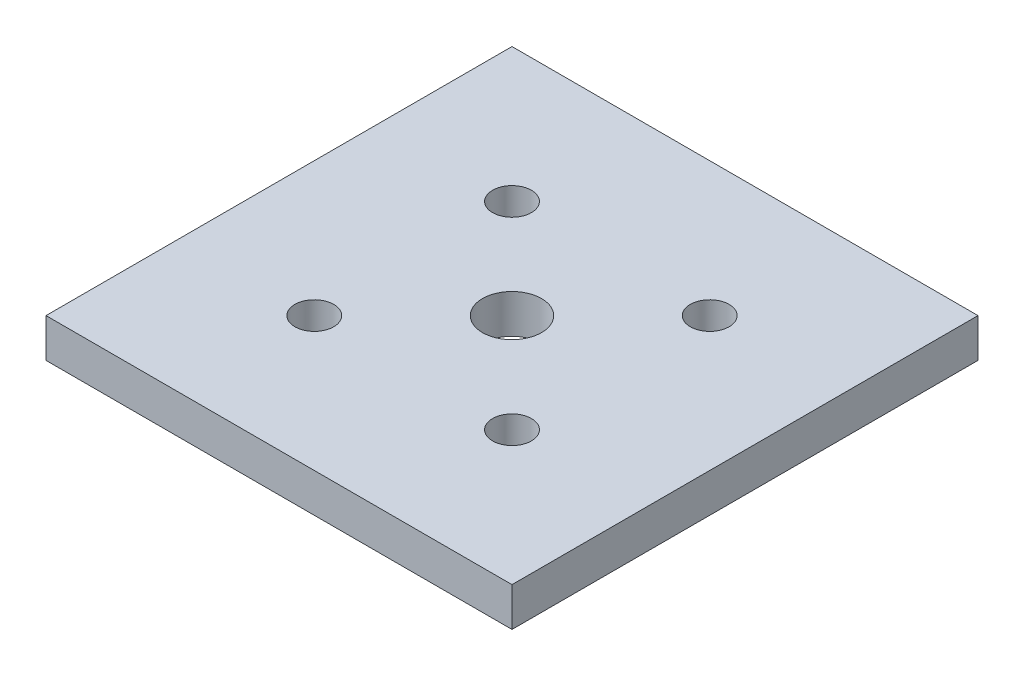
ISO-10303-21;
HEADER;
FILE_DESCRIPTION(('STEP AP214'),'2;1');
FILE_NAME('part.step','',(''),(''),'','','');
FILE_SCHEMA(('AUTOMOTIVE_DESIGN { 1 0 10303 214 1 1 1 1 }'));
ENDSEC;
DATA;
#1=APPLICATION_CONTEXT('core data for automotive mechanical design processes');
#2=APPLICATION_PROTOCOL_DEFINITION('international standard','automotive_design',2000,#1);
#3=PRODUCT_CONTEXT('',#1,'mechanical');
#4=PRODUCT('Part','Part','',(#3));
#5=PRODUCT_RELATED_PRODUCT_CATEGORY('part','',(#4));
#6=PRODUCT_DEFINITION_FORMATION('','',#4);
#7=PRODUCT_DEFINITION_CONTEXT('part definition',#1,'design');
#8=PRODUCT_DEFINITION('design','',#6,#7);
#9=PRODUCT_DEFINITION_SHAPE('','',#8);
#10=(LENGTH_UNIT() NAMED_UNIT(*) SI_UNIT(.MILLI.,.METRE.));
#11=(NAMED_UNIT(*) PLANE_ANGLE_UNIT() SI_UNIT($,.RADIAN.));
#12=(NAMED_UNIT(*) SI_UNIT($,.STERADIAN.) SOLID_ANGLE_UNIT());
#13=UNCERTAINTY_MEASURE_WITH_UNIT(LENGTH_MEASURE(1.E-05),#10,'distance_accuracy_value','');
#14=(GEOMETRIC_REPRESENTATION_CONTEXT(3) GLOBAL_UNCERTAINTY_ASSIGNED_CONTEXT((#13)) GLOBAL_UNIT_ASSIGNED_CONTEXT((#10,
#11,#12)) REPRESENTATION_CONTEXT('',''));
#15=CARTESIAN_POINT('',(0.,0.,0.));
#16=DIRECTION('',(0.,0.,1.));
#17=DIRECTION('',(1.,0.,0.));
#18=AXIS2_PLACEMENT_3D('',#15,#16,#17);
#19=CARTESIAN_POINT('',(0.,5.,0.));
#20=DIRECTION('',(0.,1.,0.));
#21=DIRECTION('',(0.,0.,1.));
#22=AXIS2_PLACEMENT_3D('',#19,#20,#21);
#23=PLANE('',#22);
#24=CARTESIAN_POINT('',(12.7279220613579,5.,12.7279220613579));
#25=DIRECTION('',(0.,1.,0.));
#26=DIRECTION('',(0.,0.,1.));
#27=AXIS2_PLACEMENT_3D('',#24,#25,#26);
#28=CIRCLE('',#27,2.5);
#29=CARTESIAN_POINT('',(12.7279220613579,5.,15.2279220613579));
#30=VERTEX_POINT('',#29);
#31=EDGE_CURVE('E137',#30,#30,#28,.T.);
#32=ORIENTED_EDGE('',*,*,#31,.F.);
#33=EDGE_LOOP('',(#32));
#34=FACE_BOUND('',#33,.T.);
#35=CARTESIAN_POINT('',(-12.7279220613579,5.,-12.7279220613579));
#36=DIRECTION('',(0.,1.,0.));
#37=DIRECTION('',(0.,0.,1.));
#38=AXIS2_PLACEMENT_3D('',#35,#36,#37);
#39=CIRCLE('',#38,2.5);
#40=CARTESIAN_POINT('',(-12.7279220613579,5.,-10.2279220613579));
#41=VERTEX_POINT('',#40);
#42=EDGE_CURVE('E125',#41,#41,#39,.T.);
#43=ORIENTED_EDGE('',*,*,#42,.F.);
#44=EDGE_LOOP('',(#43));
#45=FACE_BOUND('',#44,.T.);
#46=DIRECTION('',(0.,0.,1.));
#47=VECTOR('',#46,1.);
#48=CARTESIAN_POINT('',(-30.,5.,30.));
#49=LINE('',#48,#47);
#50=CARTESIAN_POINT('',(-30.,5.,-30.));
#51=VERTEX_POINT('',#50);
#52=CARTESIAN_POINT('',(-30.,5.,30.));
#53=VERTEX_POINT('',#52);
#54=EDGE_CURVE('E95',#51,#53,#49,.T.);
#55=ORIENTED_EDGE('',*,*,#54,.T.);
#56=DIRECTION('',(1.,0.,0.));
#57=VECTOR('',#56,1.);
#58=CARTESIAN_POINT('',(30.,5.,30.));
#59=LINE('',#58,#57);
#60=CARTESIAN_POINT('',(30.,5.,30.));
#61=VERTEX_POINT('',#60);
#62=EDGE_CURVE('E90',#53,#61,#59,.T.);
#63=ORIENTED_EDGE('',*,*,#62,.T.);
#64=DIRECTION('',(0.,0.,-1.));
#65=VECTOR('',#64,1.);
#66=CARTESIAN_POINT('',(30.,5.,30.));
#67=LINE('',#66,#65);
#68=CARTESIAN_POINT('',(30.,5.,-30.));
#69=VERTEX_POINT('',#68);
#70=EDGE_CURVE('E93',#61,#69,#67,.T.);
#71=ORIENTED_EDGE('',*,*,#70,.T.);
#72=DIRECTION('',(-1.,0.,0.));
#73=VECTOR('',#72,1.);
#74=CARTESIAN_POINT('',(30.,5.,-30.));
#75=LINE('',#74,#73);
#76=EDGE_CURVE('E60',#69,#51,#75,.T.);
#77=ORIENTED_EDGE('',*,*,#76,.T.);
#78=EDGE_LOOP('',(#55,#63,#71,#77));
#79=FACE_BOUND('',#78,.T.);
#80=CARTESIAN_POINT('',(0.,5.,0.));
#81=DIRECTION('',(0.,1.,0.));
#82=DIRECTION('',(0.,0.,1.));
#83=AXIS2_PLACEMENT_3D('',#80,#81,#82);
#84=CIRCLE('',#83,3.8);
#85=CARTESIAN_POINT('',(0.,5.,3.8));
#86=VERTEX_POINT('',#85);
#87=EDGE_CURVE('E110',#86,#86,#84,.T.);
#88=ORIENTED_EDGE('',*,*,#87,.F.);
#89=EDGE_LOOP('',(#88));
#90=FACE_BOUND('',#89,.T.);
#91=CARTESIAN_POINT('',(12.7279220613579,5.,-12.7279220613579));
#92=DIRECTION('',(0.,1.,0.));
#93=DIRECTION('',(0.,0.,-1.));
#94=AXIS2_PLACEMENT_3D('',#91,#92,#93);
#95=CIRCLE('',#94,2.5);
#96=CARTESIAN_POINT('',(12.7279220613579,5.,-15.2279220613579));
#97=VERTEX_POINT('',#96);
#98=EDGE_CURVE('E131',#97,#97,#95,.T.);
#99=ORIENTED_EDGE('',*,*,#98,.F.);
#100=EDGE_LOOP('',(#99));
#101=FACE_BOUND('',#100,.T.);
#102=CARTESIAN_POINT('',(-12.7279220613579,5.,12.7279220613579));
#103=DIRECTION('',(0.,1.,0.));
#104=DIRECTION('',(0.,0.,-1.));
#105=AXIS2_PLACEMENT_3D('',#102,#103,#104);
#106=CIRCLE('',#105,2.5);
#107=CARTESIAN_POINT('',(-12.7279220613579,5.,10.2279220613579));
#108=VERTEX_POINT('',#107);
#109=EDGE_CURVE('E143',#108,#108,#106,.T.);
#110=ORIENTED_EDGE('',*,*,#109,.F.);
#111=EDGE_LOOP('',(#110));
#112=FACE_BOUND('',#111,.T.);
#113=ADVANCED_FACE('F43',(#34,#45,#79,#90,#101,#112),#23,.T.);
#114=CARTESIAN_POINT('',(0.,0.,0.));
#115=DIRECTION('',(0.,1.,0.));
#116=DIRECTION('',(0.,0.,1.));
#117=AXIS2_PLACEMENT_3D('',#114,#115,#116);
#118=PLANE('',#117);
#119=DIRECTION('',(0.,0.,1.));
#120=VECTOR('',#119,1.);
#121=CARTESIAN_POINT('',(-30.,0.,30.));
#122=LINE('',#121,#120);
#123=CARTESIAN_POINT('',(-30.,0.,-30.));
#124=VERTEX_POINT('',#123);
#125=CARTESIAN_POINT('',(-30.,0.,30.));
#126=VERTEX_POINT('',#125);
#127=EDGE_CURVE('E107',#124,#126,#122,.T.);
#128=ORIENTED_EDGE('',*,*,#127,.F.);
#129=DIRECTION('',(-1.,0.,0.));
#130=VECTOR('',#129,1.);
#131=CARTESIAN_POINT('',(30.,0.,-30.));
#132=LINE('',#131,#130);
#133=CARTESIAN_POINT('',(30.,0.,-30.));
#134=VERTEX_POINT('',#133);
#135=EDGE_CURVE('E83',#134,#124,#132,.T.);
#136=ORIENTED_EDGE('',*,*,#135,.F.);
#137=DIRECTION('',(0.,0.,-1.));
#138=VECTOR('',#137,1.);
#139=CARTESIAN_POINT('',(30.,0.,30.));
#140=LINE('',#139,#138);
#141=CARTESIAN_POINT('',(30.,0.,30.));
#142=VERTEX_POINT('',#141);
#143=EDGE_CURVE('E77',#142,#134,#140,.T.);
#144=ORIENTED_EDGE('',*,*,#143,.F.);
#145=DIRECTION('',(1.,0.,0.));
#146=VECTOR('',#145,1.);
#147=CARTESIAN_POINT('',(30.,0.,30.));
#148=LINE('',#147,#146);
#149=EDGE_CURVE('E99',#126,#142,#148,.T.);
#150=ORIENTED_EDGE('',*,*,#149,.F.);
#151=EDGE_LOOP('',(#128,#136,#144,#150));
#152=FACE_BOUND('',#151,.T.);
#153=CARTESIAN_POINT('',(0.,0.,0.));
#154=DIRECTION('',(0.,1.,0.));
#155=DIRECTION('',(0.,0.,1.));
#156=AXIS2_PLACEMENT_3D('',#153,#154,#155);
#157=CIRCLE('',#156,3.8);
#158=CARTESIAN_POINT('',(0.,0.,3.8));
#159=VERTEX_POINT('',#158);
#160=EDGE_CURVE('E122',#159,#159,#157,.T.);
#161=ORIENTED_EDGE('',*,*,#160,.T.);
#162=EDGE_LOOP('',(#161));
#163=FACE_BOUND('',#162,.T.);
#164=CARTESIAN_POINT('',(-12.7279220613579,0.,-12.7279220613579));
#165=DIRECTION('',(0.,1.,0.));
#166=DIRECTION('',(0.,0.,1.));
#167=AXIS2_PLACEMENT_3D('',#164,#165,#166);
#168=CIRCLE('',#167,2.5);
#169=CARTESIAN_POINT('',(-12.7279220613579,0.,-10.2279220613579));
#170=VERTEX_POINT('',#169);
#171=EDGE_CURVE('E128',#170,#170,#168,.T.);
#172=ORIENTED_EDGE('',*,*,#171,.T.);
#173=EDGE_LOOP('',(#172));
#174=FACE_BOUND('',#173,.T.);
#175=CARTESIAN_POINT('',(12.7279220613579,0.,-12.7279220613579));
#176=DIRECTION('',(0.,1.,0.));
#177=DIRECTION('',(0.,0.,-1.));
#178=AXIS2_PLACEMENT_3D('',#175,#176,#177);
#179=CIRCLE('',#178,2.5);
#180=CARTESIAN_POINT('',(12.7279220613579,0.,-15.2279220613579));
#181=VERTEX_POINT('',#180);
#182=EDGE_CURVE('E134',#181,#181,#179,.T.);
#183=ORIENTED_EDGE('',*,*,#182,.T.);
#184=EDGE_LOOP('',(#183));
#185=FACE_BOUND('',#184,.T.);
#186=CARTESIAN_POINT('',(12.7279220613579,0.,12.7279220613579));
#187=DIRECTION('',(0.,1.,0.));
#188=DIRECTION('',(0.,0.,1.));
#189=AXIS2_PLACEMENT_3D('',#186,#187,#188);
#190=CIRCLE('',#189,2.5);
#191=CARTESIAN_POINT('',(12.7279220613579,0.,15.2279220613579));
#192=VERTEX_POINT('',#191);
#193=EDGE_CURVE('E140',#192,#192,#190,.T.);
#194=ORIENTED_EDGE('',*,*,#193,.T.);
#195=EDGE_LOOP('',(#194));
#196=FACE_BOUND('',#195,.T.);
#197=CARTESIAN_POINT('',(-12.7279220613579,0.,12.7279220613579));
#198=DIRECTION('',(0.,1.,0.));
#199=DIRECTION('',(0.,0.,-1.));
#200=AXIS2_PLACEMENT_3D('',#197,#198,#199);
#201=CIRCLE('',#200,2.5);
#202=CARTESIAN_POINT('',(-12.7279220613579,0.,10.2279220613579));
#203=VERTEX_POINT('',#202);
#204=EDGE_CURVE('E146',#203,#203,#201,.T.);
#205=ORIENTED_EDGE('',*,*,#204,.T.);
#206=EDGE_LOOP('',(#205));
#207=FACE_BOUND('',#206,.T.);
#208=ADVANCED_FACE('F118',(#152,#163,#174,#185,#196,#207),#118,.F.);
#209=CARTESIAN_POINT('',(-30.,5.,30.));
#210=DIRECTION('',(1.,0.,0.));
#211=DIRECTION('',(0.,0.,-1.));
#212=AXIS2_PLACEMENT_3D('',#209,#210,#211);
#213=PLANE('',#212);
#214=ORIENTED_EDGE('',*,*,#127,.T.);
#215=DIRECTION('',(0.,-1.,0.));
#216=VECTOR('',#215,1.);
#217=CARTESIAN_POINT('',(-30.,5.,30.));
#218=LINE('',#217,#216);
#219=EDGE_CURVE('E11',#53,#126,#218,.T.);
#220=ORIENTED_EDGE('',*,*,#219,.F.);
#221=ORIENTED_EDGE('',*,*,#54,.F.);
#222=DIRECTION('',(0.,-1.,0.));
#223=VECTOR('',#222,1.);
#224=CARTESIAN_POINT('',(-30.,5.,-30.));
#225=LINE('',#224,#223);
#226=EDGE_CURVE('E103',#51,#124,#225,.T.);
#227=ORIENTED_EDGE('',*,*,#226,.T.);
#228=EDGE_LOOP('',(#214,#220,#221,#227));
#229=FACE_BOUND('',#228,.T.);
#230=ADVANCED_FACE('F45',(#229),#213,.F.);
#231=CARTESIAN_POINT('',(30.,5.,30.));
#232=DIRECTION('',(0.,0.,-1.));
#233=DIRECTION('',(-1.,0.,0.));
#234=AXIS2_PLACEMENT_3D('',#231,#232,#233);
#235=PLANE('',#234);
#236=ORIENTED_EDGE('',*,*,#149,.T.);
#237=DIRECTION('',(0.,-1.,0.));
#238=VECTOR('',#237,1.);
#239=CARTESIAN_POINT('',(30.,5.,30.));
#240=LINE('',#239,#238);
#241=EDGE_CURVE('E52',#61,#142,#240,.T.);
#242=ORIENTED_EDGE('',*,*,#241,.F.);
#243=ORIENTED_EDGE('',*,*,#62,.F.);
#244=ORIENTED_EDGE('',*,*,#219,.T.);
#245=EDGE_LOOP('',(#236,#242,#243,#244));
#246=FACE_BOUND('',#245,.T.);
#247=ADVANCED_FACE('F98',(#246),#235,.F.);
#248=CARTESIAN_POINT('',(30.,5.,30.));
#249=DIRECTION('',(-1.,0.,0.));
#250=DIRECTION('',(0.,0.,1.));
#251=AXIS2_PLACEMENT_3D('',#248,#249,#250);
#252=PLANE('',#251);
#253=ORIENTED_EDGE('',*,*,#143,.T.);
#254=DIRECTION('',(0.,-1.,0.));
#255=VECTOR('',#254,1.);
#256=CARTESIAN_POINT('',(30.,5.,-30.));
#257=LINE('',#256,#255);
#258=EDGE_CURVE('E100',#69,#134,#257,.T.);
#259=ORIENTED_EDGE('',*,*,#258,.F.);
#260=ORIENTED_EDGE('',*,*,#70,.F.);
#261=ORIENTED_EDGE('',*,*,#241,.T.);
#262=EDGE_LOOP('',(#253,#259,#260,#261));
#263=FACE_BOUND('',#262,.T.);
#264=ADVANCED_FACE('F101',(#263),#252,.F.);
#265=CARTESIAN_POINT('',(30.,5.,-30.));
#266=DIRECTION('',(0.,0.,1.));
#267=DIRECTION('',(1.,0.,0.));
#268=AXIS2_PLACEMENT_3D('',#265,#266,#267);
#269=PLANE('',#268);
#270=ORIENTED_EDGE('',*,*,#135,.T.);
#271=ORIENTED_EDGE('',*,*,#226,.F.);
#272=ORIENTED_EDGE('',*,*,#76,.F.);
#273=ORIENTED_EDGE('',*,*,#258,.T.);
#274=EDGE_LOOP('',(#270,#271,#272,#273));
#275=FACE_BOUND('',#274,.T.);
#276=ADVANCED_FACE('F115',(#275),#269,.F.);
#277=CARTESIAN_POINT('',(0.,5.,0.));
#278=DIRECTION('',(0.,-1.,0.));
#279=DIRECTION('',(0.,0.,-1.));
#280=AXIS2_PLACEMENT_3D('',#277,#278,#279);
#281=CYLINDRICAL_SURFACE('',#280,3.8);
#282=ORIENTED_EDGE('',*,*,#87,.T.);
#283=EDGE_LOOP('',(#282));
#284=FACE_BOUND('',#283,.T.);
#285=ORIENTED_EDGE('',*,*,#160,.F.);
#286=EDGE_LOOP('',(#285));
#287=FACE_BOUND('',#286,.T.);
#288=ADVANCED_FACE('F165',(#284,#287),#281,.F.);
#289=CARTESIAN_POINT('',(-12.7279220613579,5.,-12.7279220613579));
#290=DIRECTION('',(0.,-1.,0.));
#291=DIRECTION('',(0.,0.,-1.));
#292=AXIS2_PLACEMENT_3D('',#289,#290,#291);
#293=CYLINDRICAL_SURFACE('',#292,2.5);
#294=ORIENTED_EDGE('',*,*,#42,.T.);
#295=EDGE_LOOP('',(#294));
#296=FACE_BOUND('',#295,.T.);
#297=ORIENTED_EDGE('',*,*,#171,.F.);
#298=EDGE_LOOP('',(#297));
#299=FACE_BOUND('',#298,.T.);
#300=ADVANCED_FACE('F210',(#296,#299),#293,.F.);
#301=CARTESIAN_POINT('',(12.7279220613579,5.,-12.7279220613579));
#302=DIRECTION('',(0.,-1.,0.));
#303=DIRECTION('',(0.,0.,-1.));
#304=AXIS2_PLACEMENT_3D('',#301,#302,#303);
#305=CYLINDRICAL_SURFACE('',#304,2.5);
#306=ORIENTED_EDGE('',*,*,#98,.T.);
#307=EDGE_LOOP('',(#306));
#308=FACE_BOUND('',#307,.T.);
#309=ORIENTED_EDGE('',*,*,#182,.F.);
#310=EDGE_LOOP('',(#309));
#311=FACE_BOUND('',#310,.T.);
#312=ADVANCED_FACE('F218',(#308,#311),#305,.F.);
#313=CARTESIAN_POINT('',(12.7279220613579,5.,12.7279220613579));
#314=DIRECTION('',(0.,-1.,0.));
#315=DIRECTION('',(0.,0.,-1.));
#316=AXIS2_PLACEMENT_3D('',#313,#314,#315);
#317=CYLINDRICAL_SURFACE('',#316,2.5);
#318=ORIENTED_EDGE('',*,*,#31,.T.);
#319=EDGE_LOOP('',(#318));
#320=FACE_BOUND('',#319,.T.);
#321=ORIENTED_EDGE('',*,*,#193,.F.);
#322=EDGE_LOOP('',(#321));
#323=FACE_BOUND('',#322,.T.);
#324=ADVANCED_FACE('F226',(#320,#323),#317,.F.);
#325=CARTESIAN_POINT('',(-12.7279220613579,5.,12.7279220613579));
#326=DIRECTION('',(0.,-1.,0.));
#327=DIRECTION('',(0.,0.,-1.));
#328=AXIS2_PLACEMENT_3D('',#325,#326,#327);
#329=CYLINDRICAL_SURFACE('',#328,2.5);
#330=ORIENTED_EDGE('',*,*,#109,.T.);
#331=EDGE_LOOP('',(#330));
#332=FACE_BOUND('',#331,.T.);
#333=ORIENTED_EDGE('',*,*,#204,.F.);
#334=EDGE_LOOP('',(#333));
#335=FACE_BOUND('',#334,.T.);
#336=ADVANCED_FACE('F152',(#332,#335),#329,.F.);
#337=CLOSED_SHELL('',(#113,#208,#230,#247,#264,#276,#288,#300,#312,#324,#336));
#338=MANIFOLD_SOLID_BREP('B2',#337);
#339=ADVANCED_BREP_SHAPE_REPRESENTATION('',(#18,#338),#14);
#340=SHAPE_DEFINITION_REPRESENTATION(#9,#339);
ENDSEC;
END-ISO-10303-21;
